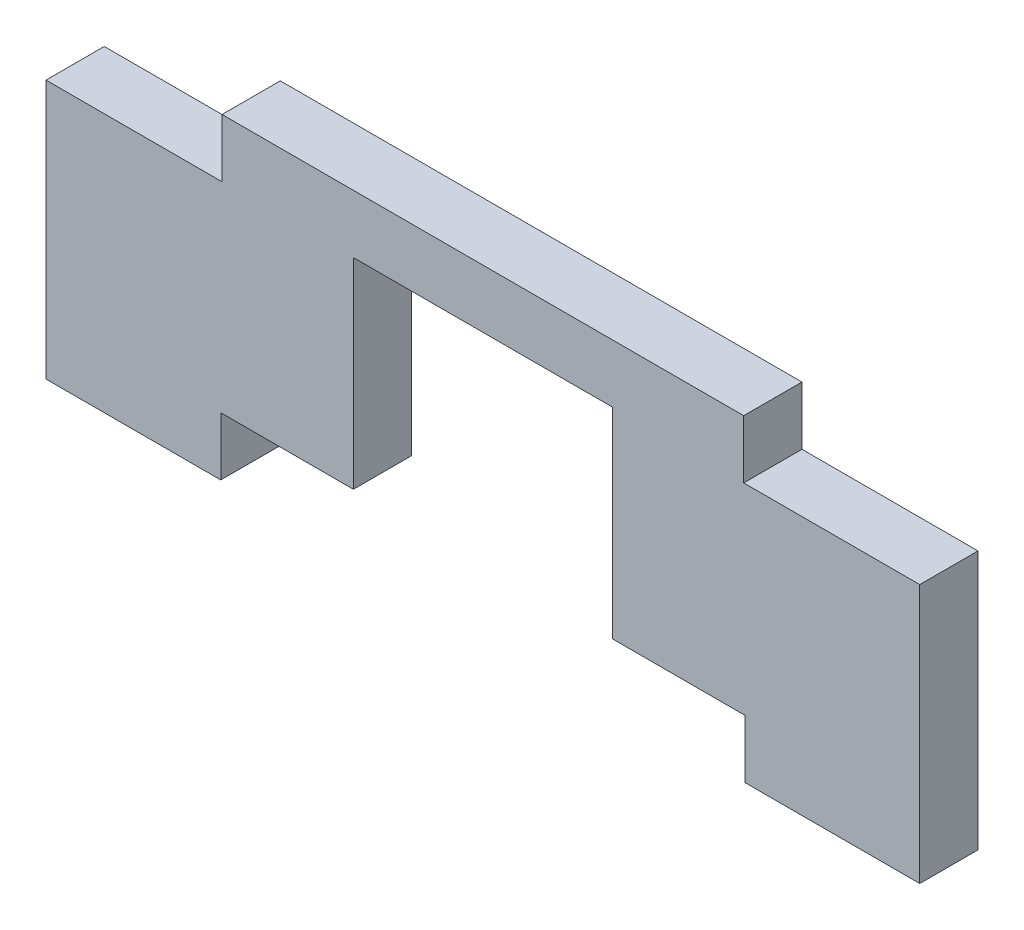
ISO-10303-21;
HEADER;
FILE_DESCRIPTION(('STEP AP214'),'2;1');
FILE_NAME('part.step','',(''),(''),'','','');
FILE_SCHEMA(('AUTOMOTIVE_DESIGN { 1 0 10303 214 1 1 1 1 }'));
ENDSEC;
DATA;
#1=APPLICATION_CONTEXT('core data for automotive mechanical design processes');
#2=APPLICATION_PROTOCOL_DEFINITION('international standard','automotive_design',2000,#1);
#3=PRODUCT_CONTEXT('',#1,'mechanical');
#4=PRODUCT('Part','Part','',(#3));
#5=PRODUCT_RELATED_PRODUCT_CATEGORY('part','',(#4));
#6=PRODUCT_DEFINITION_FORMATION('','',#4);
#7=PRODUCT_DEFINITION_CONTEXT('part definition',#1,'design');
#8=PRODUCT_DEFINITION('design','',#6,#7);
#9=PRODUCT_DEFINITION_SHAPE('','',#8);
#10=(LENGTH_UNIT() NAMED_UNIT(*) SI_UNIT(.MILLI.,.METRE.));
#11=(NAMED_UNIT(*) PLANE_ANGLE_UNIT() SI_UNIT($,.RADIAN.));
#12=(NAMED_UNIT(*) SI_UNIT($,.STERADIAN.) SOLID_ANGLE_UNIT());
#13=UNCERTAINTY_MEASURE_WITH_UNIT(LENGTH_MEASURE(1.E-05),#10,'distance_accuracy_value','');
#14=(GEOMETRIC_REPRESENTATION_CONTEXT(3) GLOBAL_UNCERTAINTY_ASSIGNED_CONTEXT((#13)) GLOBAL_UNIT_ASSIGNED_CONTEXT((#10,
#11,#12)) REPRESENTATION_CONTEXT('',''));
#15=CARTESIAN_POINT('',(0.,0.,0.));
#16=DIRECTION('',(0.,0.,1.));
#17=DIRECTION('',(1.,0.,0.));
#18=AXIS2_PLACEMENT_3D('',#15,#16,#17);
#19=CARTESIAN_POINT('',(-52.0369055451286,116.914823412849,222.248004760979));
#20=DIRECTION('',(0.,1.,0.));
#21=DIRECTION('',(-1.,0.,0.));
#22=AXIS2_PLACEMENT_3D('',#19,#20,#21);
#23=PLANE('',#22);
#24=DIRECTION('',(-1.,0.,0.));
#25=VECTOR('',#24,1.);
#26=CARTESIAN_POINT('',(-52.0369055451286,116.914823412849,232.248004760979));
#27=LINE('',#26,#25);
#28=CARTESIAN_POINT('',(-52.0369055451286,116.914823412849,232.248004760979));
#29=VERTEX_POINT('',#28);
#30=CARTESIAN_POINT('',(-82.2574738828129,116.914823412849,232.248004760979));
#31=VERTEX_POINT('',#30);
#32=EDGE_CURVE('E177',#29,#31,#27,.T.);
#33=ORIENTED_EDGE('',*,*,#32,.F.);
#34=DIRECTION('',(0.,0.,1.));
#35=VECTOR('',#34,1.);
#36=CARTESIAN_POINT('',(-52.0369055451286,116.914823412849,222.248004760979));
#37=LINE('',#36,#35);
#38=CARTESIAN_POINT('',(-52.0369055451286,116.914823412849,222.248004760979));
#39=VERTEX_POINT('',#38);
#40=EDGE_CURVE('E11',#39,#29,#37,.T.);
#41=ORIENTED_EDGE('',*,*,#40,.F.);
#42=DIRECTION('',(-1.,0.,0.));
#43=VECTOR('',#42,1.);
#44=CARTESIAN_POINT('',(-52.0369055451286,116.914823412849,222.248004760979));
#45=LINE('',#44,#43);
#46=CARTESIAN_POINT('',(-82.2574738828129,116.914823412849,222.248004760979));
#47=VERTEX_POINT('',#46);
#48=EDGE_CURVE('E221',#39,#47,#45,.T.);
#49=ORIENTED_EDGE('',*,*,#48,.T.);
#50=DIRECTION('',(0.,0.,1.));
#51=VECTOR('',#50,1.);
#52=CARTESIAN_POINT('',(-82.2574738828129,116.914823412849,222.248004760979));
#53=LINE('',#52,#51);
#54=EDGE_CURVE('E36',#47,#31,#53,.T.);
#55=ORIENTED_EDGE('',*,*,#54,.T.);
#56=EDGE_LOOP('',(#33,#41,#49,#55));
#57=FACE_BOUND('',#56,.T.);
#58=ADVANCED_FACE('F33',(#57),#23,.T.);
#59=CARTESIAN_POINT('',(-52.0369055451286,126.914823412849,222.248004760979));
#60=DIRECTION('',(-1.,0.,0.));
#61=DIRECTION('',(0.,-1.,0.));
#62=AXIS2_PLACEMENT_3D('',#59,#60,#61);
#63=PLANE('',#62);
#64=DIRECTION('',(0.,-1.,0.));
#65=VECTOR('',#64,1.);
#66=CARTESIAN_POINT('',(-52.0369055451286,126.914823412849,232.248004760979));
#67=LINE('',#66,#65);
#68=CARTESIAN_POINT('',(-52.0369055451286,126.914823412849,232.248004760979));
#69=VERTEX_POINT('',#68);
#70=EDGE_CURVE('E219',#69,#29,#67,.T.);
#71=ORIENTED_EDGE('',*,*,#70,.F.);
#72=DIRECTION('',(0.,0.,1.));
#73=VECTOR('',#72,1.);
#74=CARTESIAN_POINT('',(-52.0369055451286,126.914823412849,222.248004760979));
#75=LINE('',#74,#73);
#76=CARTESIAN_POINT('',(-52.0369055451286,126.914823412849,222.248004760979));
#77=VERTEX_POINT('',#76);
#78=EDGE_CURVE('E42',#77,#69,#75,.T.);
#79=ORIENTED_EDGE('',*,*,#78,.F.);
#80=DIRECTION('',(0.,-1.,0.));
#81=VECTOR('',#80,1.);
#82=CARTESIAN_POINT('',(-52.0369055451286,126.914823412849,222.248004760979));
#83=LINE('',#82,#81);
#84=EDGE_CURVE('E167',#77,#39,#83,.T.);
#85=ORIENTED_EDGE('',*,*,#84,.T.);
#86=ORIENTED_EDGE('',*,*,#40,.T.);
#87=EDGE_LOOP('',(#71,#79,#85,#86));
#88=FACE_BOUND('',#87,.T.);
#89=ADVANCED_FACE('F250',(#88),#63,.T.);
#90=CARTESIAN_POINT('',(-52.0369055451286,126.914823412849,222.248004760979));
#91=DIRECTION('',(0.,1.,0.));
#92=DIRECTION('',(0.,0.,1.));
#93=AXIS2_PLACEMENT_3D('',#90,#91,#92);
#94=PLANE('',#93);
#95=DIRECTION('',(-1.,0.,0.));
#96=VECTOR('',#95,1.);
#97=CARTESIAN_POINT('',(-52.0369055451286,126.914823412849,232.248004760979));
#98=LINE('',#97,#96);
#99=CARTESIAN_POINT('',(37.5219577795028,126.914823412849,232.248004760979));
#100=VERTEX_POINT('',#99);
#101=EDGE_CURVE('E154',#100,#69,#98,.T.);
#102=ORIENTED_EDGE('',*,*,#101,.F.);
#103=DIRECTION('',(0.,0.,1.));
#104=VECTOR('',#103,1.);
#105=CARTESIAN_POINT('',(37.5219577795028,126.914823412849,222.248004760979));
#106=LINE('',#105,#104);
#107=CARTESIAN_POINT('',(37.5219577795028,126.914823412849,222.248004760979));
#108=VERTEX_POINT('',#107);
#109=EDGE_CURVE('E149',#108,#100,#106,.T.);
#110=ORIENTED_EDGE('',*,*,#109,.F.);
#111=DIRECTION('',(-1.,0.,0.));
#112=VECTOR('',#111,1.);
#113=CARTESIAN_POINT('',(-52.0369055451286,126.914823412849,222.248004760979));
#114=LINE('',#113,#112);
#115=EDGE_CURVE('E152',#108,#77,#114,.T.);
#116=ORIENTED_EDGE('',*,*,#115,.T.);
#117=ORIENTED_EDGE('',*,*,#78,.T.);
#118=EDGE_LOOP('',(#102,#110,#116,#117));
#119=FACE_BOUND('',#118,.T.);
#120=ADVANCED_FACE('F151',(#119),#94,.T.);
#121=CARTESIAN_POINT('',(37.5219577795028,126.914823412849,222.248004760979));
#122=DIRECTION('',(1.,0.,0.));
#123=DIRECTION('',(0.,1.,0.));
#124=AXIS2_PLACEMENT_3D('',#121,#122,#123);
#125=PLANE('',#124);
#126=DIRECTION('',(0.,1.,0.));
#127=VECTOR('',#126,1.);
#128=CARTESIAN_POINT('',(37.5219577795028,126.914823412849,232.248004760979));
#129=LINE('',#128,#127);
#130=CARTESIAN_POINT('',(37.5219577795028,116.914823412849,232.248004760979));
#131=VERTEX_POINT('',#130);
#132=EDGE_CURVE('E216',#131,#100,#129,.T.);
#133=ORIENTED_EDGE('',*,*,#132,.F.);
#134=DIRECTION('',(0.,0.,1.));
#135=VECTOR('',#134,1.);
#136=CARTESIAN_POINT('',(37.5219577795028,116.914823412849,222.248004760979));
#137=LINE('',#136,#135);
#138=CARTESIAN_POINT('',(37.5219577795028,116.914823412849,222.248004760979));
#139=VERTEX_POINT('',#138);
#140=EDGE_CURVE('E159',#139,#131,#137,.T.);
#141=ORIENTED_EDGE('',*,*,#140,.F.);
#142=DIRECTION('',(0.,1.,0.));
#143=VECTOR('',#142,1.);
#144=CARTESIAN_POINT('',(37.5219577795028,126.914823412849,222.248004760979));
#145=LINE('',#144,#143);
#146=EDGE_CURVE('E165',#139,#108,#145,.T.);
#147=ORIENTED_EDGE('',*,*,#146,.T.);
#148=ORIENTED_EDGE('',*,*,#109,.T.);
#149=EDGE_LOOP('',(#133,#141,#147,#148));
#150=FACE_BOUND('',#149,.T.);
#151=ADVANCED_FACE('F169',(#150),#125,.T.);
#152=CARTESIAN_POINT('',(37.5219577795028,116.914823412849,222.248004760979));
#153=DIRECTION('',(0.,1.,0.));
#154=DIRECTION('',(-1.,0.,0.));
#155=AXIS2_PLACEMENT_3D('',#152,#153,#154);
#156=PLANE('',#155);
#157=DIRECTION('',(-1.,0.,0.));
#158=VECTOR('',#157,1.);
#159=CARTESIAN_POINT('',(37.5219577795028,116.914823412849,232.248004760979));
#160=LINE('',#159,#158);
#161=CARTESIAN_POINT('',(67.7425261171871,116.914823412849,232.248004760979));
#162=VERTEX_POINT('',#161);
#163=EDGE_CURVE('E213',#162,#131,#160,.T.);
#164=ORIENTED_EDGE('',*,*,#163,.F.);
#165=DIRECTION('',(0.,0.,1.));
#166=VECTOR('',#165,1.);
#167=CARTESIAN_POINT('',(67.7425261171871,116.914823412849,222.248004760979));
#168=LINE('',#167,#166);
#169=CARTESIAN_POINT('',(67.7425261171871,116.914823412849,222.248004760979));
#170=VERTEX_POINT('',#169);
#171=EDGE_CURVE('E225',#170,#162,#168,.T.);
#172=ORIENTED_EDGE('',*,*,#171,.F.);
#173=DIRECTION('',(-1.,0.,0.));
#174=VECTOR('',#173,1.);
#175=CARTESIAN_POINT('',(37.5219577795028,116.914823412849,222.248004760979));
#176=LINE('',#175,#174);
#177=EDGE_CURVE('E170',#170,#139,#176,.T.);
#178=ORIENTED_EDGE('',*,*,#177,.T.);
#179=ORIENTED_EDGE('',*,*,#140,.T.);
#180=EDGE_LOOP('',(#164,#172,#178,#179));
#181=FACE_BOUND('',#180,.T.);
#182=ADVANCED_FACE('F263',(#181),#156,.T.);
#183=CARTESIAN_POINT('',(67.7425261171871,116.914823412849,222.248004760979));
#184=DIRECTION('',(1.,0.,0.));
#185=DIRECTION('',(0.,0.,-1.));
#186=AXIS2_PLACEMENT_3D('',#183,#184,#185);
#187=PLANE('',#186);
#188=DIRECTION('',(0.,1.,0.));
#189=VECTOR('',#188,1.);
#190=CARTESIAN_POINT('',(67.7425261171871,116.914823412849,232.248004760979));
#191=LINE('',#190,#189);
#192=CARTESIAN_POINT('',(67.7425261171871,72.4648234128495,232.248004760979));
#193=VERTEX_POINT('',#192);
#194=EDGE_CURVE('E210',#193,#162,#191,.T.);
#195=ORIENTED_EDGE('',*,*,#194,.F.);
#196=DIRECTION('',(0.,0.,1.));
#197=VECTOR('',#196,1.);
#198=CARTESIAN_POINT('',(67.7425261171871,72.4648234128495,222.248004760979));
#199=LINE('',#198,#197);
#200=CARTESIAN_POINT('',(67.7425261171871,72.4648234128495,222.248004760979));
#201=VERTEX_POINT('',#200);
#202=EDGE_CURVE('E227',#201,#193,#199,.T.);
#203=ORIENTED_EDGE('',*,*,#202,.F.);
#204=DIRECTION('',(0.,1.,0.));
#205=VECTOR('',#204,1.);
#206=CARTESIAN_POINT('',(67.7425261171871,82.4648234128495,222.248004760979));
#207=LINE('',#206,#205);
#208=EDGE_CURVE('E172',#201,#170,#207,.T.);
#209=ORIENTED_EDGE('',*,*,#208,.T.);
#210=ORIENTED_EDGE('',*,*,#171,.T.);
#211=EDGE_LOOP('',(#195,#203,#209,#210));
#212=FACE_BOUND('',#211,.T.);
#213=ADVANCED_FACE('F266',(#212),#187,.T.);
#214=CARTESIAN_POINT('',(67.7425261171871,72.4648234128495,222.248004760979));
#215=DIRECTION('',(0.,-1.,0.));
#216=DIRECTION('',(1.,0.,0.));
#217=AXIS2_PLACEMENT_3D('',#214,#215,#216);
#218=PLANE('',#217);
#219=DIRECTION('',(1.,0.,0.));
#220=VECTOR('',#219,1.);
#221=CARTESIAN_POINT('',(67.7425261171871,72.4648234128495,232.248004760979));
#222=LINE('',#221,#220);
#223=CARTESIAN_POINT('',(37.7425261171871,72.4648234128495,232.248004760979));
#224=VERTEX_POINT('',#223);
#225=EDGE_CURVE('E207',#224,#193,#222,.T.);
#226=ORIENTED_EDGE('',*,*,#225,.F.);
#227=DIRECTION('',(0.,0.,1.));
#228=VECTOR('',#227,1.);
#229=CARTESIAN_POINT('',(37.7425261171871,72.4648234128495,222.248004760979));
#230=LINE('',#229,#228);
#231=CARTESIAN_POINT('',(37.7425261171871,72.4648234128495,222.248004760979));
#232=VERTEX_POINT('',#231);
#233=EDGE_CURVE('E230',#232,#224,#230,.T.);
#234=ORIENTED_EDGE('',*,*,#233,.F.);
#235=DIRECTION('',(1.,0.,0.));
#236=VECTOR('',#235,1.);
#237=CARTESIAN_POINT('',(67.7425261171871,72.4648234128495,222.248004760979));
#238=LINE('',#237,#236);
#239=EDGE_CURVE('E453',#232,#201,#238,.T.);
#240=ORIENTED_EDGE('',*,*,#239,.T.);
#241=ORIENTED_EDGE('',*,*,#202,.T.);
#242=EDGE_LOOP('',(#226,#234,#240,#241));
#243=FACE_BOUND('',#242,.T.);
#244=ADVANCED_FACE('F270',(#243),#218,.T.);
#245=CARTESIAN_POINT('',(37.7425261171871,72.4648234128495,222.248004760979));
#246=DIRECTION('',(-1.,0.,0.));
#247=DIRECTION('',(0.,0.,1.));
#248=AXIS2_PLACEMENT_3D('',#245,#246,#247);
#249=PLANE('',#248);
#250=DIRECTION('',(0.,-1.,0.));
#251=VECTOR('',#250,1.);
#252=CARTESIAN_POINT('',(37.7425261171871,72.4648234128495,232.248004760979));
#253=LINE('',#252,#251);
#254=CARTESIAN_POINT('',(37.7425261171871,82.4648234128495,232.248004760979));
#255=VERTEX_POINT('',#254);
#256=EDGE_CURVE('E204',#255,#224,#253,.T.);
#257=ORIENTED_EDGE('',*,*,#256,.F.);
#258=DIRECTION('',(0.,0.,1.));
#259=VECTOR('',#258,1.);
#260=CARTESIAN_POINT('',(37.7425261171871,82.4648234128495,222.248004760979));
#261=LINE('',#260,#259);
#262=CARTESIAN_POINT('',(37.7425261171871,82.4648234128495,222.248004760979));
#263=VERTEX_POINT('',#262);
#264=EDGE_CURVE('E232',#263,#255,#261,.T.);
#265=ORIENTED_EDGE('',*,*,#264,.F.);
#266=DIRECTION('',(0.,-1.,0.));
#267=VECTOR('',#266,1.);
#268=CARTESIAN_POINT('',(37.7425261171871,72.4648234128495,222.248004760979));
#269=LINE('',#268,#267);
#270=EDGE_CURVE('E450',#263,#232,#269,.T.);
#271=ORIENTED_EDGE('',*,*,#270,.T.);
#272=ORIENTED_EDGE('',*,*,#233,.T.);
#273=EDGE_LOOP('',(#257,#265,#271,#272));
#274=FACE_BOUND('',#273,.T.);
#275=ADVANCED_FACE('F274',(#274),#249,.T.);
#276=CARTESIAN_POINT('',(37.7425261171871,82.4648234128495,222.248004760979));
#277=DIRECTION('',(0.,-1.,0.));
#278=DIRECTION('',(0.,0.,-1.));
#279=AXIS2_PLACEMENT_3D('',#276,#277,#278);
#280=PLANE('',#279);
#281=DIRECTION('',(1.,0.,0.));
#282=VECTOR('',#281,1.);
#283=CARTESIAN_POINT('',(37.7425261171871,82.4648234128495,232.248004760979));
#284=LINE('',#283,#282);
#285=CARTESIAN_POINT('',(14.9675261171871,82.4648234128495,232.248004760979));
#286=VERTEX_POINT('',#285);
#287=EDGE_CURVE('E201',#286,#255,#284,.T.);
#288=ORIENTED_EDGE('',*,*,#287,.F.);
#289=DIRECTION('',(0.,0.,1.));
#290=VECTOR('',#289,1.);
#291=CARTESIAN_POINT('',(14.9675261171871,82.4648234128495,222.248004760979));
#292=LINE('',#291,#290);
#293=CARTESIAN_POINT('',(14.9675261171871,82.4648234128495,222.248004760979));
#294=VERTEX_POINT('',#293);
#295=EDGE_CURVE('E234',#294,#286,#292,.T.);
#296=ORIENTED_EDGE('',*,*,#295,.F.);
#297=DIRECTION('',(1.,0.,0.));
#298=VECTOR('',#297,1.);
#299=CARTESIAN_POINT('',(37.7425261171871,82.4648234128495,222.248004760979));
#300=LINE('',#299,#298);
#301=EDGE_CURVE('E459',#294,#263,#300,.T.);
#302=ORIENTED_EDGE('',*,*,#301,.T.);
#303=ORIENTED_EDGE('',*,*,#264,.T.);
#304=EDGE_LOOP('',(#288,#296,#302,#303));
#305=FACE_BOUND('',#304,.T.);
#306=ADVANCED_FACE('F278',(#305),#280,.T.);
#307=CARTESIAN_POINT('',(14.9675261171871,82.4648234128495,222.248004760979));
#308=DIRECTION('',(-1.,0.,0.));
#309=DIRECTION('',(0.,-1.,0.));
#310=AXIS2_PLACEMENT_3D('',#307,#308,#309);
#311=PLANE('',#310);
#312=DIRECTION('',(0.,-1.,0.));
#313=VECTOR('',#312,1.);
#314=CARTESIAN_POINT('',(14.9675261171871,82.4648234128495,232.248004760979));
#315=LINE('',#314,#313);
#316=CARTESIAN_POINT('',(14.9675261171871,116.914823412849,232.248004760979));
#317=VERTEX_POINT('',#316);
#318=EDGE_CURVE('E198',#317,#286,#315,.T.);
#319=ORIENTED_EDGE('',*,*,#318,.F.);
#320=DIRECTION('',(0.,0.,1.));
#321=VECTOR('',#320,1.);
#322=CARTESIAN_POINT('',(14.9675261171871,116.914823412849,222.248004760979));
#323=LINE('',#322,#321);
#324=CARTESIAN_POINT('',(14.9675261171871,116.914823412849,222.248004760979));
#325=VERTEX_POINT('',#324);
#326=EDGE_CURVE('E236',#325,#317,#323,.T.);
#327=ORIENTED_EDGE('',*,*,#326,.F.);
#328=DIRECTION('',(0.,-1.,0.));
#329=VECTOR('',#328,1.);
#330=CARTESIAN_POINT('',(14.9675261171871,82.4648234128495,222.248004760979));
#331=LINE('',#330,#329);
#332=EDGE_CURVE('E443',#325,#294,#331,.T.);
#333=ORIENTED_EDGE('',*,*,#332,.T.);
#334=ORIENTED_EDGE('',*,*,#295,.T.);
#335=EDGE_LOOP('',(#319,#327,#333,#334));
#336=FACE_BOUND('',#335,.T.);
#337=ADVANCED_FACE('F282',(#336),#311,.T.);
#338=CARTESIAN_POINT('',(-29.4824738828129,116.914823412849,222.248004760979));
#339=DIRECTION('',(0.,-1.,0.));
#340=DIRECTION('',(0.,0.,-1.));
#341=AXIS2_PLACEMENT_3D('',#338,#339,#340);
#342=PLANE('',#341);
#343=DIRECTION('',(1.,0.,0.));
#344=VECTOR('',#343,1.);
#345=CARTESIAN_POINT('',(-29.4824738828129,116.914823412849,232.248004760979));
#346=LINE('',#345,#344);
#347=CARTESIAN_POINT('',(-29.4824738828129,116.914823412849,232.248004760979));
#348=VERTEX_POINT('',#347);
#349=EDGE_CURVE('E195',#348,#317,#346,.T.);
#350=ORIENTED_EDGE('',*,*,#349,.F.);
#351=DIRECTION('',(0.,0.,1.));
#352=VECTOR('',#351,1.);
#353=CARTESIAN_POINT('',(-29.4824738828129,116.914823412849,222.248004760979));
#354=LINE('',#353,#352);
#355=CARTESIAN_POINT('',(-29.4824738828129,116.914823412849,222.248004760979));
#356=VERTEX_POINT('',#355);
#357=EDGE_CURVE('E238',#356,#348,#354,.T.);
#358=ORIENTED_EDGE('',*,*,#357,.F.);
#359=DIRECTION('',(1.,0.,0.));
#360=VECTOR('',#359,1.);
#361=CARTESIAN_POINT('',(-29.4824738828129,116.914823412849,222.248004760979));
#362=LINE('',#361,#360);
#363=EDGE_CURVE('E439',#356,#325,#362,.T.);
#364=ORIENTED_EDGE('',*,*,#363,.T.);
#365=ORIENTED_EDGE('',*,*,#326,.T.);
#366=EDGE_LOOP('',(#350,#358,#364,#365));
#367=FACE_BOUND('',#366,.T.);
#368=ADVANCED_FACE('F286',(#367),#342,.T.);
#369=CARTESIAN_POINT('',(-29.4824738828129,82.4648234128495,222.248004760979));
#370=DIRECTION('',(1.,0.,0.));
#371=DIRECTION('',(0.,1.,0.));
#372=AXIS2_PLACEMENT_3D('',#369,#370,#371);
#373=PLANE('',#372);
#374=DIRECTION('',(0.,1.,0.));
#375=VECTOR('',#374,1.);
#376=CARTESIAN_POINT('',(-29.4824738828129,82.4648234128495,232.248004760979));
#377=LINE('',#376,#375);
#378=CARTESIAN_POINT('',(-29.4824738828129,82.4648234128495,232.248004760979));
#379=VERTEX_POINT('',#378);
#380=EDGE_CURVE('E192',#379,#348,#377,.T.);
#381=ORIENTED_EDGE('',*,*,#380,.F.);
#382=DIRECTION('',(0.,0.,1.));
#383=VECTOR('',#382,1.);
#384=CARTESIAN_POINT('',(-29.4824738828129,82.4648234128495,222.248004760979));
#385=LINE('',#384,#383);
#386=CARTESIAN_POINT('',(-29.4824738828129,82.4648234128495,222.248004760979));
#387=VERTEX_POINT('',#386);
#388=EDGE_CURVE('E240',#387,#379,#385,.T.);
#389=ORIENTED_EDGE('',*,*,#388,.F.);
#390=DIRECTION('',(0.,1.,0.));
#391=VECTOR('',#390,1.);
#392=CARTESIAN_POINT('',(-29.4824738828129,82.4648234128495,222.248004760979));
#393=LINE('',#392,#391);
#394=EDGE_CURVE('E463',#387,#356,#393,.T.);
#395=ORIENTED_EDGE('',*,*,#394,.T.);
#396=ORIENTED_EDGE('',*,*,#357,.T.);
#397=EDGE_LOOP('',(#381,#389,#395,#396));
#398=FACE_BOUND('',#397,.T.);
#399=ADVANCED_FACE('F290',(#398),#373,.T.);
#400=CARTESIAN_POINT('',(-52.2574738828129,82.4648234128495,222.248004760979));
#401=DIRECTION('',(0.,-1.,0.));
#402=DIRECTION('',(0.,0.,-1.));
#403=AXIS2_PLACEMENT_3D('',#400,#401,#402);
#404=PLANE('',#403);
#405=DIRECTION('',(1.,0.,0.));
#406=VECTOR('',#405,1.);
#407=CARTESIAN_POINT('',(-52.2574738828129,82.4648234128495,232.248004760979));
#408=LINE('',#407,#406);
#409=CARTESIAN_POINT('',(-52.2574738828129,82.4648234128495,232.248004760979));
#410=VERTEX_POINT('',#409);
#411=EDGE_CURVE('E189',#410,#379,#408,.T.);
#412=ORIENTED_EDGE('',*,*,#411,.F.);
#413=DIRECTION('',(0.,0.,1.));
#414=VECTOR('',#413,1.);
#415=CARTESIAN_POINT('',(-52.2574738828129,82.4648234128495,222.248004760979));
#416=LINE('',#415,#414);
#417=CARTESIAN_POINT('',(-52.2574738828129,82.4648234128495,222.248004760979));
#418=VERTEX_POINT('',#417);
#419=EDGE_CURVE('E242',#418,#410,#416,.T.);
#420=ORIENTED_EDGE('',*,*,#419,.F.);
#421=DIRECTION('',(1.,0.,0.));
#422=VECTOR('',#421,1.);
#423=CARTESIAN_POINT('',(-52.2574738828129,82.4648234128495,222.248004760979));
#424=LINE('',#423,#422);
#425=EDGE_CURVE('E432',#418,#387,#424,.T.);
#426=ORIENTED_EDGE('',*,*,#425,.T.);
#427=ORIENTED_EDGE('',*,*,#388,.T.);
#428=EDGE_LOOP('',(#412,#420,#426,#427));
#429=FACE_BOUND('',#428,.T.);
#430=ADVANCED_FACE('F294',(#429),#404,.T.);
#431=CARTESIAN_POINT('',(-52.2574738828129,72.4648234128495,222.248004760979));
#432=DIRECTION('',(1.,0.,0.));
#433=DIRECTION('',(0.,0.,-1.));
#434=AXIS2_PLACEMENT_3D('',#431,#432,#433);
#435=PLANE('',#434);
#436=DIRECTION('',(0.,1.,0.));
#437=VECTOR('',#436,1.);
#438=CARTESIAN_POINT('',(-52.2574738828129,72.4648234128495,232.248004760979));
#439=LINE('',#438,#437);
#440=CARTESIAN_POINT('',(-52.2574738828129,72.4648234128495,232.248004760979));
#441=VERTEX_POINT('',#440);
#442=EDGE_CURVE('E186',#441,#410,#439,.T.);
#443=ORIENTED_EDGE('',*,*,#442,.F.);
#444=DIRECTION('',(0.,0.,1.));
#445=VECTOR('',#444,1.);
#446=CARTESIAN_POINT('',(-52.2574738828129,72.4648234128495,222.248004760979));
#447=LINE('',#446,#445);
#448=CARTESIAN_POINT('',(-52.2574738828129,72.4648234128495,222.248004760979));
#449=VERTEX_POINT('',#448);
#450=EDGE_CURVE('E244',#449,#441,#447,.T.);
#451=ORIENTED_EDGE('',*,*,#450,.F.);
#452=DIRECTION('',(0.,1.,0.));
#453=VECTOR('',#452,1.);
#454=CARTESIAN_POINT('',(-52.2574738828129,72.4648234128495,222.248004760979));
#455=LINE('',#454,#453);
#456=EDGE_CURVE('E428',#449,#418,#455,.T.);
#457=ORIENTED_EDGE('',*,*,#456,.T.);
#458=ORIENTED_EDGE('',*,*,#419,.T.);
#459=EDGE_LOOP('',(#443,#451,#457,#458));
#460=FACE_BOUND('',#459,.T.);
#461=ADVANCED_FACE('F298',(#460),#435,.T.);
#462=CARTESIAN_POINT('',(-82.2574738828129,72.4648234128495,222.248004760979));
#463=DIRECTION('',(0.,-1.,0.));
#464=DIRECTION('',(1.,0.,0.));
#465=AXIS2_PLACEMENT_3D('',#462,#463,#464);
#466=PLANE('',#465);
#467=DIRECTION('',(1.,0.,0.));
#468=VECTOR('',#467,1.);
#469=CARTESIAN_POINT('',(-82.2574738828129,72.4648234128495,232.248004760979));
#470=LINE('',#469,#468);
#471=CARTESIAN_POINT('',(-82.2574738828129,72.4648234128495,232.248004760979));
#472=VERTEX_POINT('',#471);
#473=EDGE_CURVE('E183',#472,#441,#470,.T.);
#474=ORIENTED_EDGE('',*,*,#473,.F.);
#475=DIRECTION('',(0.,0.,1.));
#476=VECTOR('',#475,1.);
#477=CARTESIAN_POINT('',(-82.2574738828129,72.4648234128495,222.248004760979));
#478=LINE('',#477,#476);
#479=CARTESIAN_POINT('',(-82.2574738828129,72.4648234128495,222.248004760979));
#480=VERTEX_POINT('',#479);
#481=EDGE_CURVE('E245',#480,#472,#478,.T.);
#482=ORIENTED_EDGE('',*,*,#481,.F.);
#483=DIRECTION('',(1.,0.,0.));
#484=VECTOR('',#483,1.);
#485=CARTESIAN_POINT('',(-82.2574738828129,72.4648234128495,222.248004760979));
#486=LINE('',#485,#484);
#487=EDGE_CURVE('E467',#480,#449,#486,.T.);
#488=ORIENTED_EDGE('',*,*,#487,.T.);
#489=ORIENTED_EDGE('',*,*,#450,.T.);
#490=EDGE_LOOP('',(#474,#482,#488,#489));
#491=FACE_BOUND('',#490,.T.);
#492=ADVANCED_FACE('F302',(#491),#466,.T.);
#493=CARTESIAN_POINT('',(-82.2574738828129,82.4648234128495,222.248004760979));
#494=DIRECTION('',(-1.,0.,0.));
#495=DIRECTION('',(0.,-1.,0.));
#496=AXIS2_PLACEMENT_3D('',#493,#494,#495);
#497=PLANE('',#496);
#498=DIRECTION('',(0.,-1.,0.));
#499=VECTOR('',#498,1.);
#500=CARTESIAN_POINT('',(-82.2574738828129,82.4648234128495,232.248004760979));
#501=LINE('',#500,#499);
#502=EDGE_CURVE('E180',#31,#472,#501,.T.);
#503=ORIENTED_EDGE('',*,*,#502,.F.);
#504=ORIENTED_EDGE('',*,*,#54,.F.);
#505=DIRECTION('',(0.,-1.,0.));
#506=VECTOR('',#505,1.);
#507=CARTESIAN_POINT('',(-82.2574738828129,116.914823412849,222.248004760979));
#508=LINE('',#507,#506);
#509=EDGE_CURVE('E469',#47,#480,#508,.T.);
#510=ORIENTED_EDGE('',*,*,#509,.T.);
#511=ORIENTED_EDGE('',*,*,#481,.T.);
#512=EDGE_LOOP('',(#503,#504,#510,#511));
#513=FACE_BOUND('',#512,.T.);
#514=ADVANCED_FACE('F305',(#513),#497,.T.);
#515=CARTESIAN_POINT('',(-82.2574738828129,116.914823412849,222.248004760979));
#516=DIRECTION('',(0.,0.,1.));
#517=DIRECTION('',(1.,0.,0.));
#518=AXIS2_PLACEMENT_3D('',#515,#516,#517);
#519=PLANE('',#518);
#520=ORIENTED_EDGE('',*,*,#48,.F.);
#521=ORIENTED_EDGE('',*,*,#84,.F.);
#522=ORIENTED_EDGE('',*,*,#115,.F.);
#523=ORIENTED_EDGE('',*,*,#146,.F.);
#524=ORIENTED_EDGE('',*,*,#177,.F.);
#525=ORIENTED_EDGE('',*,*,#208,.F.);
#526=ORIENTED_EDGE('',*,*,#239,.F.);
#527=ORIENTED_EDGE('',*,*,#270,.F.);
#528=ORIENTED_EDGE('',*,*,#301,.F.);
#529=ORIENTED_EDGE('',*,*,#332,.F.);
#530=ORIENTED_EDGE('',*,*,#363,.F.);
#531=ORIENTED_EDGE('',*,*,#394,.F.);
#532=ORIENTED_EDGE('',*,*,#425,.F.);
#533=ORIENTED_EDGE('',*,*,#456,.F.);
#534=ORIENTED_EDGE('',*,*,#487,.F.);
#535=ORIENTED_EDGE('',*,*,#509,.F.);
#536=EDGE_LOOP('',(#520,#521,#522,#523,#524,#525,#526,#527,#528,#529,#530,#531,#532,#533,#534,#535));
#537=FACE_BOUND('',#536,.T.);
#538=ADVANCED_FACE('F163',(#537),#519,.F.);
#539=CARTESIAN_POINT('',(-82.2574738828129,116.914823412849,232.248004760979));
#540=DIRECTION('',(0.,0.,1.));
#541=DIRECTION('',(1.,0.,0.));
#542=AXIS2_PLACEMENT_3D('',#539,#540,#541);
#543=PLANE('',#542);
#544=ORIENTED_EDGE('',*,*,#32,.T.);
#545=ORIENTED_EDGE('',*,*,#502,.T.);
#546=ORIENTED_EDGE('',*,*,#473,.T.);
#547=ORIENTED_EDGE('',*,*,#442,.T.);
#548=ORIENTED_EDGE('',*,*,#411,.T.);
#549=ORIENTED_EDGE('',*,*,#380,.T.);
#550=ORIENTED_EDGE('',*,*,#349,.T.);
#551=ORIENTED_EDGE('',*,*,#318,.T.);
#552=ORIENTED_EDGE('',*,*,#287,.T.);
#553=ORIENTED_EDGE('',*,*,#256,.T.);
#554=ORIENTED_EDGE('',*,*,#225,.T.);
#555=ORIENTED_EDGE('',*,*,#194,.T.);
#556=ORIENTED_EDGE('',*,*,#163,.T.);
#557=ORIENTED_EDGE('',*,*,#132,.T.);
#558=ORIENTED_EDGE('',*,*,#101,.T.);
#559=ORIENTED_EDGE('',*,*,#70,.T.);
#560=EDGE_LOOP('',(#544,#545,#546,#547,#548,#549,#550,#551,#552,#553,#554,#555,#556,#557,#558,#559));
#561=FACE_BOUND('',#560,.T.);
#562=ADVANCED_FACE('F249',(#561),#543,.T.);
#563=CLOSED_SHELL('',(#58,#89,#120,#151,#182,#213,#244,#275,#306,#337,#368,#399,#430,#461,#492,
#514,#538,#562));
#564=MANIFOLD_SOLID_BREP('B2',#563);
#565=ADVANCED_BREP_SHAPE_REPRESENTATION('',(#18,#564),#14);
#566=SHAPE_DEFINITION_REPRESENTATION(#9,#565);
ENDSEC;
END-ISO-10303-21;
